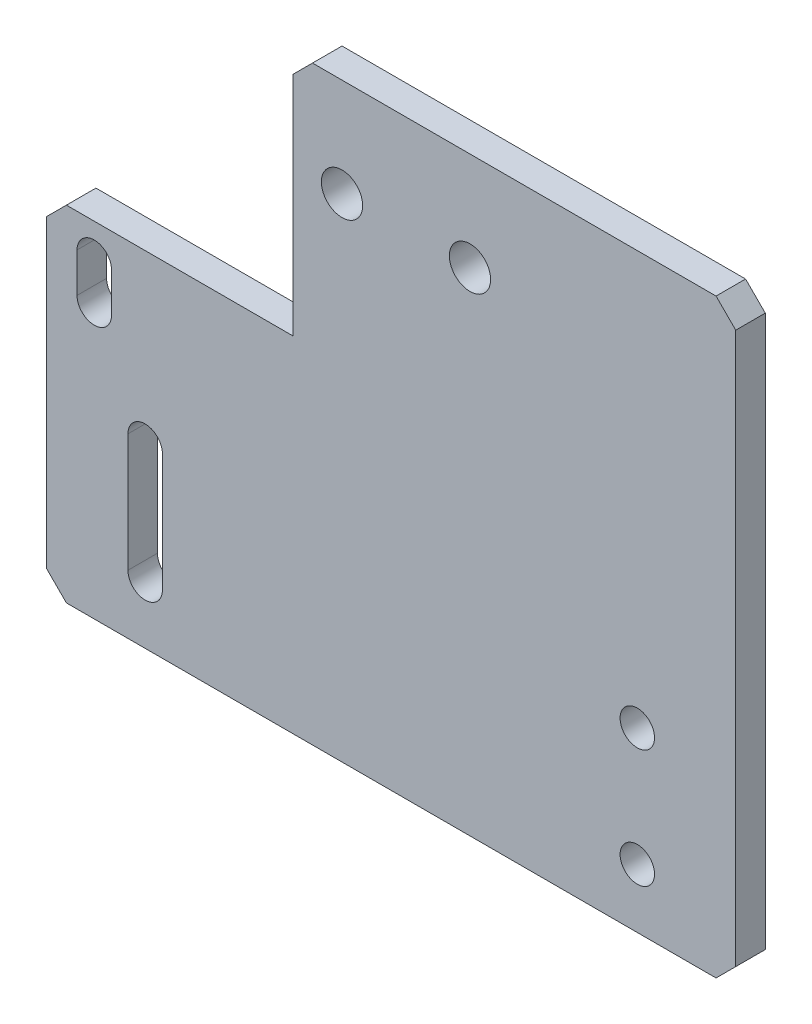
ISO-10303-21;
HEADER;
FILE_DESCRIPTION(('STEP AP214'),'2;1');
FILE_NAME('part.step','',(''),(''),'','','');
FILE_SCHEMA(('AUTOMOTIVE_DESIGN { 1 0 10303 214 1 1 1 1 }'));
ENDSEC;
DATA;
#1=APPLICATION_CONTEXT('core data for automotive mechanical design processes');
#2=APPLICATION_PROTOCOL_DEFINITION('international standard','automotive_design',2000,#1);
#3=PRODUCT_CONTEXT('',#1,'mechanical');
#4=PRODUCT('Part','Part','',(#3));
#5=PRODUCT_RELATED_PRODUCT_CATEGORY('part','',(#4));
#6=PRODUCT_DEFINITION_FORMATION('','',#4);
#7=PRODUCT_DEFINITION_CONTEXT('part definition',#1,'design');
#8=PRODUCT_DEFINITION('design','',#6,#7);
#9=PRODUCT_DEFINITION_SHAPE('','',#8);
#10=(LENGTH_UNIT() NAMED_UNIT(*) SI_UNIT(.MILLI.,.METRE.));
#11=(NAMED_UNIT(*) PLANE_ANGLE_UNIT() SI_UNIT($,.RADIAN.));
#12=(NAMED_UNIT(*) SI_UNIT($,.STERADIAN.) SOLID_ANGLE_UNIT());
#13=UNCERTAINTY_MEASURE_WITH_UNIT(LENGTH_MEASURE(1.E-05),#10,'distance_accuracy_value','');
#14=(GEOMETRIC_REPRESENTATION_CONTEXT(3) GLOBAL_UNCERTAINTY_ASSIGNED_CONTEXT((#13)) GLOBAL_UNIT_ASSIGNED_CONTEXT((#10,
#11,#12)) REPRESENTATION_CONTEXT('',''));
#15=CARTESIAN_POINT('',(0.,0.,0.));
#16=DIRECTION('',(0.,0.,1.));
#17=DIRECTION('',(1.,0.,0.));
#18=AXIS2_PLACEMENT_3D('',#15,#16,#17);
#19=CARTESIAN_POINT('',(0.,0.,3.));
#20=DIRECTION('',(0.,0.,-1.));
#21=DIRECTION('',(-1.,0.,0.));
#22=AXIS2_PLACEMENT_3D('',#19,#20,#21);
#23=PLANE('',#22);
#24=CARTESIAN_POINT('',(-26.8303571428571,-15.15625,3.));
#25=DIRECTION('',(0.,0.,1.));
#26=DIRECTION('',(1.,0.,0.));
#27=AXIS2_PLACEMENT_3D('',#24,#25,#26);
#28=CIRCLE('',#27,1.75);
#29=CARTESIAN_POINT('',(-25.0803571428571,-15.15625,3.));
#30=VERTEX_POINT('',#29);
#31=CARTESIAN_POINT('',(-28.5803571428571,-15.15625,3.));
#32=VERTEX_POINT('',#31);
#33=EDGE_CURVE('E211',#30,#32,#28,.T.);
#34=ORIENTED_EDGE('',*,*,#33,.F.);
#35=DIRECTION('',(0.,1.,0.));
#36=VECTOR('',#35,1.);
#37=CARTESIAN_POINT('',(-25.0803571428571,-15.15625,3.));
#38=LINE('',#37,#36);
#39=CARTESIAN_POINT('',(-25.0803571428571,-27.15625,3.));
#40=VERTEX_POINT('',#39);
#41=EDGE_CURVE('E219',#40,#30,#38,.T.);
#42=ORIENTED_EDGE('',*,*,#41,.F.);
#43=CARTESIAN_POINT('',(-26.8303571428571,-27.15625,3.));
#44=DIRECTION('',(0.,0.,1.));
#45=DIRECTION('',(1.,0.,0.));
#46=AXIS2_PLACEMENT_3D('',#43,#44,#45);
#47=CIRCLE('',#46,1.75);
#48=CARTESIAN_POINT('',(-28.5803571428571,-27.15625,3.));
#49=VERTEX_POINT('',#48);
#50=EDGE_CURVE('E216',#49,#40,#47,.T.);
#51=ORIENTED_EDGE('',*,*,#50,.F.);
#52=DIRECTION('',(0.,-1.,0.));
#53=VECTOR('',#52,1.);
#54=CARTESIAN_POINT('',(-28.5803571428571,-15.15625,3.));
#55=LINE('',#54,#53);
#56=EDGE_CURVE('E213',#32,#49,#55,.T.);
#57=ORIENTED_EDGE('',*,*,#56,.F.);
#58=EDGE_LOOP('',(#34,#42,#51,#57));
#59=FACE_BOUND('',#58,.T.);
#60=DIRECTION('',(-1.,0.,0.));
#61=VECTOR('',#60,1.);
#62=CARTESIAN_POINT('',(-36.8303571428571,1.84375,3.));
#63=LINE('',#62,#61);
#64=CARTESIAN_POINT('',(-11.8303571428571,1.84375,3.));
#65=VERTEX_POINT('',#64);
#66=CARTESIAN_POINT('',(-34.8303571428571,1.84375,3.));
#67=VERTEX_POINT('',#66);
#68=EDGE_CURVE('E262',#65,#67,#63,.T.);
#69=ORIENTED_EDGE('',*,*,#68,.T.);
#70=DIRECTION('',(0.707106781186548,0.707106781186548,0.));
#71=VECTOR('',#70,1.);
#72=CARTESIAN_POINT('',(-36.8303571428571,-0.156250000000004,3.));
#73=LINE('',#72,#71);
#74=CARTESIAN_POINT('',(-36.8303571428571,-0.156250000000004,3.));
#75=VERTEX_POINT('',#74);
#76=EDGE_CURVE('E317',#67,#75,#73,.F.);
#77=ORIENTED_EDGE('',*,*,#76,.T.);
#78=DIRECTION('',(0.,-1.,0.));
#79=VECTOR('',#78,1.);
#80=CARTESIAN_POINT('',(-36.8303571428571,-33.15625,3.));
#81=LINE('',#80,#79);
#82=CARTESIAN_POINT('',(-36.8303571428571,-31.15625,3.));
#83=VERTEX_POINT('',#82);
#84=EDGE_CURVE('E266',#75,#83,#81,.T.);
#85=ORIENTED_EDGE('',*,*,#84,.T.);
#86=DIRECTION('',(-0.707106781186545,0.70710678118655,0.));
#87=VECTOR('',#86,1.);
#88=CARTESIAN_POINT('',(-34.8303571428571,-33.15625,3.));
#89=LINE('',#88,#87);
#90=CARTESIAN_POINT('',(-34.8303571428571,-33.15625,3.));
#91=VERTEX_POINT('',#90);
#92=EDGE_CURVE('E315',#83,#91,#89,.F.);
#93=ORIENTED_EDGE('',*,*,#92,.T.);
#94=DIRECTION('',(1.,0.,0.));
#95=VECTOR('',#94,1.);
#96=CARTESIAN_POINT('',(33.1696428571429,-33.15625,3.));
#97=LINE('',#96,#95);
#98=CARTESIAN_POINT('',(31.1696428571429,-33.15625,3.));
#99=VERTEX_POINT('',#98);
#100=EDGE_CURVE('E269',#91,#99,#97,.T.);
#101=ORIENTED_EDGE('',*,*,#100,.T.);
#102=DIRECTION('',(-0.70710678118655,-0.707106781186545,0.));
#103=VECTOR('',#102,1.);
#104=CARTESIAN_POINT('',(33.1696428571429,-31.15625,3.));
#105=LINE('',#104,#103);
#106=CARTESIAN_POINT('',(33.1696428571429,-31.15625,3.));
#107=VERTEX_POINT('',#106);
#108=EDGE_CURVE('E313',#99,#107,#105,.F.);
#109=ORIENTED_EDGE('',*,*,#108,.T.);
#110=DIRECTION('',(0.,1.,0.));
#111=VECTOR('',#110,1.);
#112=CARTESIAN_POINT('',(33.1696428571429,26.84375,3.));
#113=LINE('',#112,#111);
#114=CARTESIAN_POINT('',(33.1696428571429,24.84375,3.));
#115=VERTEX_POINT('',#114);
#116=EDGE_CURVE('E272',#107,#115,#113,.T.);
#117=ORIENTED_EDGE('',*,*,#116,.T.);
#118=DIRECTION('',(0.707106781186545,-0.70710678118655,0.));
#119=VECTOR('',#118,1.);
#120=CARTESIAN_POINT('',(31.1696428571429,26.84375,3.));
#121=LINE('',#120,#119);
#122=CARTESIAN_POINT('',(31.1696428571428,26.84375,3.));
#123=VERTEX_POINT('',#122);
#124=EDGE_CURVE('E55',#115,#123,#121,.F.);
#125=ORIENTED_EDGE('',*,*,#124,.T.);
#126=DIRECTION('',(-1.,0.,0.));
#127=VECTOR('',#126,1.);
#128=CARTESIAN_POINT('',(-11.8303571428571,26.84375,3.));
#129=LINE('',#128,#127);
#130=CARTESIAN_POINT('',(-9.83035714285712,26.84375,3.));
#131=VERTEX_POINT('',#130);
#132=EDGE_CURVE('E274',#123,#131,#129,.T.);
#133=ORIENTED_EDGE('',*,*,#132,.T.);
#134=DIRECTION('',(0.70710678118655,0.707106781186545,0.));
#135=VECTOR('',#134,1.);
#136=CARTESIAN_POINT('',(-11.8303571428571,24.84375,3.));
#137=LINE('',#136,#135);
#138=CARTESIAN_POINT('',(-11.8303571428571,24.84375,3.));
#139=VERTEX_POINT('',#138);
#140=EDGE_CURVE('E310',#131,#139,#137,.F.);
#141=ORIENTED_EDGE('',*,*,#140,.T.);
#142=DIRECTION('',(0.,-1.,0.));
#143=VECTOR('',#142,1.);
#144=CARTESIAN_POINT('',(-11.8303571428571,1.84375,3.));
#145=LINE('',#144,#143);
#146=EDGE_CURVE('E260',#139,#65,#145,.T.);
#147=ORIENTED_EDGE('',*,*,#146,.T.);
#148=EDGE_LOOP('',(#69,#77,#85,#93,#101,#109,#117,#125,#133,#141,#147));
#149=FACE_BOUND('',#148,.T.);
#150=CARTESIAN_POINT('',(23.1696428571429,-15.15625,3.));
#151=DIRECTION('',(0.,0.,1.));
#152=DIRECTION('',(1.,0.,0.));
#153=AXIS2_PLACEMENT_3D('',#150,#151,#152);
#154=CIRCLE('',#153,1.75);
#155=CARTESIAN_POINT('',(24.9196428571429,-15.15625,3.));
#156=VERTEX_POINT('',#155);
#157=EDGE_CURVE('E254',#156,#156,#154,.T.);
#158=ORIENTED_EDGE('',*,*,#157,.F.);
#159=EDGE_LOOP('',(#158));
#160=FACE_BOUND('',#159,.T.);
#161=CARTESIAN_POINT('',(23.1696428571429,-27.15625,3.));
#162=DIRECTION('',(0.,0.,1.));
#163=DIRECTION('',(1.,0.,0.));
#164=AXIS2_PLACEMENT_3D('',#161,#162,#163);
#165=CIRCLE('',#164,1.75);
#166=CARTESIAN_POINT('',(24.9196428571429,-27.15625,3.));
#167=VERTEX_POINT('',#166);
#168=EDGE_CURVE('E248',#167,#167,#165,.T.);
#169=ORIENTED_EDGE('',*,*,#168,.F.);
#170=EDGE_LOOP('',(#169));
#171=FACE_BOUND('',#170,.T.);
#172=CARTESIAN_POINT('',(-6.83035714285712,16.84375,3.));
#173=DIRECTION('',(0.,0.,1.));
#174=DIRECTION('',(1.,0.,0.));
#175=AXIS2_PLACEMENT_3D('',#172,#173,#174);
#176=CIRCLE('',#175,2.09631372890607);
#177=CARTESIAN_POINT('',(-4.73404341395105,16.84375,3.));
#178=VERTEX_POINT('',#177);
#179=EDGE_CURVE('E242',#178,#178,#176,.T.);
#180=ORIENTED_EDGE('',*,*,#179,.F.);
#181=EDGE_LOOP('',(#180));
#182=FACE_BOUND('',#181,.T.);
#183=CARTESIAN_POINT('',(-32.,-1.55803571428572,3.));
#184=DIRECTION('',(0.,0.,1.));
#185=DIRECTION('',(1.,0.,0.));
#186=AXIS2_PLACEMENT_3D('',#183,#184,#185);
#187=CIRCLE('',#186,1.75);
#188=CARTESIAN_POINT('',(-30.25,-1.55803571428572,3.));
#189=VERTEX_POINT('',#188);
#190=CARTESIAN_POINT('',(-33.75,-1.55803571428572,3.));
#191=VERTEX_POINT('',#190);
#192=EDGE_CURVE('E167',#189,#191,#187,.T.);
#193=ORIENTED_EDGE('',*,*,#192,.F.);
#194=DIRECTION('',(0.,1.,0.));
#195=VECTOR('',#194,1.);
#196=CARTESIAN_POINT('',(-30.25,-1.55803571428572,3.));
#197=LINE('',#196,#195);
#198=CARTESIAN_POINT('',(-30.25,-5.55803571428572,3.));
#199=VERTEX_POINT('',#198);
#200=EDGE_CURVE('E193',#199,#189,#197,.T.);
#201=ORIENTED_EDGE('',*,*,#200,.F.);
#202=CARTESIAN_POINT('',(-32.,-5.55803571428572,3.));
#203=DIRECTION('',(0.,0.,1.));
#204=DIRECTION('',(1.,0.,0.));
#205=AXIS2_PLACEMENT_3D('',#202,#203,#204);
#206=CIRCLE('',#205,1.75);
#207=CARTESIAN_POINT('',(-33.75,-5.55803571428572,3.));
#208=VERTEX_POINT('',#207);
#209=EDGE_CURVE('E191',#208,#199,#206,.T.);
#210=ORIENTED_EDGE('',*,*,#209,.F.);
#211=DIRECTION('',(0.,-1.,0.));
#212=VECTOR('',#211,1.);
#213=CARTESIAN_POINT('',(-33.75,-1.55803571428572,3.));
#214=LINE('',#213,#212);
#215=EDGE_CURVE('E177',#191,#208,#214,.T.);
#216=ORIENTED_EDGE('',*,*,#215,.F.);
#217=EDGE_LOOP('',(#193,#201,#210,#216));
#218=FACE_BOUND('',#217,.T.);
#219=CARTESIAN_POINT('',(6.16964285714288,16.84375,3.));
#220=DIRECTION('',(0.,0.,1.));
#221=DIRECTION('',(1.,0.,0.));
#222=AXIS2_PLACEMENT_3D('',#219,#220,#221);
#223=CIRCLE('',#222,2.09631372890607);
#224=CARTESIAN_POINT('',(8.26595658604895,16.84375,3.));
#225=VERTEX_POINT('',#224);
#226=EDGE_CURVE('E200',#225,#225,#223,.T.);
#227=ORIENTED_EDGE('',*,*,#226,.F.);
#228=EDGE_LOOP('',(#227));
#229=FACE_BOUND('',#228,.T.);
#230=ADVANCED_FACE('F33',(#59,#149,#160,#171,#182,#218,#229),#23,.F.);
#231=CARTESIAN_POINT('',(0.,0.,0.));
#232=DIRECTION('',(0.,0.,-1.));
#233=DIRECTION('',(-1.,0.,0.));
#234=AXIS2_PLACEMENT_3D('',#231,#232,#233);
#235=PLANE('',#234);
#236=DIRECTION('',(0.,1.,0.));
#237=VECTOR('',#236,1.);
#238=CARTESIAN_POINT('',(-30.25,-1.55803571428572,0.));
#239=LINE('',#238,#237);
#240=CARTESIAN_POINT('',(-30.25,-5.55803571428572,0.));
#241=VERTEX_POINT('',#240);
#242=CARTESIAN_POINT('',(-30.25,-1.55803571428572,0.));
#243=VERTEX_POINT('',#242);
#244=EDGE_CURVE('E178',#241,#243,#239,.T.);
#245=ORIENTED_EDGE('',*,*,#244,.T.);
#246=CARTESIAN_POINT('',(-32.,-1.55803571428572,0.));
#247=DIRECTION('',(0.,0.,1.));
#248=DIRECTION('',(1.,0.,0.));
#249=AXIS2_PLACEMENT_3D('',#246,#247,#248);
#250=CIRCLE('',#249,1.75);
#251=CARTESIAN_POINT('',(-33.75,-1.55803571428572,0.));
#252=VERTEX_POINT('',#251);
#253=EDGE_CURVE('E198',#243,#252,#250,.T.);
#254=ORIENTED_EDGE('',*,*,#253,.T.);
#255=DIRECTION('',(0.,-1.,0.));
#256=VECTOR('',#255,1.);
#257=CARTESIAN_POINT('',(-33.75,-1.55803571428572,0.));
#258=LINE('',#257,#256);
#259=CARTESIAN_POINT('',(-33.75,-5.55803571428572,0.));
#260=VERTEX_POINT('',#259);
#261=EDGE_CURVE('E184',#252,#260,#258,.T.);
#262=ORIENTED_EDGE('',*,*,#261,.T.);
#263=CARTESIAN_POINT('',(-32.,-5.55803571428572,0.));
#264=DIRECTION('',(0.,0.,1.));
#265=DIRECTION('',(1.,0.,0.));
#266=AXIS2_PLACEMENT_3D('',#263,#264,#265);
#267=CIRCLE('',#266,1.75);
#268=EDGE_CURVE('E202',#260,#241,#267,.T.);
#269=ORIENTED_EDGE('',*,*,#268,.T.);
#270=EDGE_LOOP('',(#245,#254,#262,#269));
#271=FACE_BOUND('',#270,.T.);
#272=DIRECTION('',(0.,1.,0.));
#273=VECTOR('',#272,1.);
#274=CARTESIAN_POINT('',(-25.0803571428571,-15.15625,0.));
#275=LINE('',#274,#273);
#276=CARTESIAN_POINT('',(-25.0803571428571,-27.15625,0.));
#277=VERTEX_POINT('',#276);
#278=CARTESIAN_POINT('',(-25.0803571428571,-15.15625,0.));
#279=VERTEX_POINT('',#278);
#280=EDGE_CURVE('E214',#277,#279,#275,.T.);
#281=ORIENTED_EDGE('',*,*,#280,.T.);
#282=CARTESIAN_POINT('',(-26.8303571428571,-15.15625,0.));
#283=DIRECTION('',(0.,0.,1.));
#284=DIRECTION('',(1.,0.,0.));
#285=AXIS2_PLACEMENT_3D('',#282,#283,#284);
#286=CIRCLE('',#285,1.75);
#287=CARTESIAN_POINT('',(-28.5803571428571,-15.15625,0.));
#288=VERTEX_POINT('',#287);
#289=EDGE_CURVE('E185',#279,#288,#286,.T.);
#290=ORIENTED_EDGE('',*,*,#289,.T.);
#291=DIRECTION('',(0.,-1.,0.));
#292=VECTOR('',#291,1.);
#293=CARTESIAN_POINT('',(-28.5803571428571,-15.15625,0.));
#294=LINE('',#293,#292);
#295=CARTESIAN_POINT('',(-28.5803571428571,-27.15625,0.));
#296=VERTEX_POINT('',#295);
#297=EDGE_CURVE('E224',#288,#296,#294,.T.);
#298=ORIENTED_EDGE('',*,*,#297,.T.);
#299=CARTESIAN_POINT('',(-26.8303571428571,-27.15625,0.));
#300=DIRECTION('',(0.,0.,1.));
#301=DIRECTION('',(1.,0.,0.));
#302=AXIS2_PLACEMENT_3D('',#299,#300,#301);
#303=CIRCLE('',#302,1.75);
#304=EDGE_CURVE('E227',#296,#277,#303,.T.);
#305=ORIENTED_EDGE('',*,*,#304,.T.);
#306=EDGE_LOOP('',(#281,#290,#298,#305));
#307=FACE_BOUND('',#306,.T.);
#308=CARTESIAN_POINT('',(-6.83035714285712,16.84375,0.));
#309=DIRECTION('',(0.,0.,1.));
#310=DIRECTION('',(1.,0.,0.));
#311=AXIS2_PLACEMENT_3D('',#308,#309,#310);
#312=CIRCLE('',#311,2.09631372890607);
#313=CARTESIAN_POINT('',(-4.73404341395105,16.84375,0.));
#314=VERTEX_POINT('',#313);
#315=EDGE_CURVE('E241',#314,#314,#312,.T.);
#316=ORIENTED_EDGE('',*,*,#315,.T.);
#317=EDGE_LOOP('',(#316));
#318=FACE_BOUND('',#317,.T.);
#319=CARTESIAN_POINT('',(23.1696428571429,-15.15625,0.));
#320=DIRECTION('',(0.,0.,1.));
#321=DIRECTION('',(1.,0.,0.));
#322=AXIS2_PLACEMENT_3D('',#319,#320,#321);
#323=CIRCLE('',#322,1.75);
#324=CARTESIAN_POINT('',(24.9196428571429,-15.15625,0.));
#325=VERTEX_POINT('',#324);
#326=EDGE_CURVE('E251',#325,#325,#323,.T.);
#327=ORIENTED_EDGE('',*,*,#326,.T.);
#328=EDGE_LOOP('',(#327));
#329=FACE_BOUND('',#328,.T.);
#330=DIRECTION('',(0.,-1.,0.));
#331=VECTOR('',#330,1.);
#332=CARTESIAN_POINT('',(-36.8303571428571,-33.15625,0.));
#333=LINE('',#332,#331);
#334=CARTESIAN_POINT('',(-36.8303571428571,-0.156250000000004,0.));
#335=VERTEX_POINT('',#334);
#336=CARTESIAN_POINT('',(-36.8303571428571,-31.15625,0.));
#337=VERTEX_POINT('',#336);
#338=EDGE_CURVE('E281',#335,#337,#333,.T.);
#339=ORIENTED_EDGE('',*,*,#338,.F.);
#340=DIRECTION('',(-0.707106781186548,-0.707106781186548,0.));
#341=VECTOR('',#340,1.);
#342=CARTESIAN_POINT('',(-18.3370535714286,18.3370535714286,0.));
#343=LINE('',#342,#341);
#344=CARTESIAN_POINT('',(-34.8303571428571,1.84375,0.));
#345=VERTEX_POINT('',#344);
#346=EDGE_CURVE('E306',#335,#345,#343,.F.);
#347=ORIENTED_EDGE('',*,*,#346,.T.);
#348=DIRECTION('',(-1.,0.,0.));
#349=VECTOR('',#348,1.);
#350=CARTESIAN_POINT('',(-36.8303571428571,1.84375,0.));
#351=LINE('',#350,#349);
#352=CARTESIAN_POINT('',(-11.8303571428571,1.84375,0.));
#353=VERTEX_POINT('',#352);
#354=EDGE_CURVE('E278',#353,#345,#351,.T.);
#355=ORIENTED_EDGE('',*,*,#354,.F.);
#356=DIRECTION('',(0.,-1.,0.));
#357=VECTOR('',#356,1.);
#358=CARTESIAN_POINT('',(-11.8303571428571,1.84375,0.));
#359=LINE('',#358,#357);
#360=CARTESIAN_POINT('',(-11.8303571428571,24.84375,0.));
#361=VERTEX_POINT('',#360);
#362=EDGE_CURVE('E257',#361,#353,#359,.T.);
#363=ORIENTED_EDGE('',*,*,#362,.F.);
#364=DIRECTION('',(-0.70710678118655,-0.707106781186545,0.));
#365=VECTOR('',#364,1.);
#366=CARTESIAN_POINT('',(-18.3370535714285,18.3370535714287,0.));
#367=LINE('',#366,#365);
#368=CARTESIAN_POINT('',(-9.83035714285712,26.84375,0.));
#369=VERTEX_POINT('',#368);
#370=EDGE_CURVE('E298',#361,#369,#367,.F.);
#371=ORIENTED_EDGE('',*,*,#370,.T.);
#372=DIRECTION('',(-1.,0.,0.));
#373=VECTOR('',#372,1.);
#374=CARTESIAN_POINT('',(-11.8303571428571,26.84375,0.));
#375=LINE('',#374,#373);
#376=CARTESIAN_POINT('',(31.1696428571428,26.84375,0.));
#377=VERTEX_POINT('',#376);
#378=EDGE_CURVE('E263',#377,#369,#375,.T.);
#379=ORIENTED_EDGE('',*,*,#378,.F.);
#380=DIRECTION('',(-0.707106781186545,0.70710678118655,0.));
#381=VECTOR('',#380,1.);
#382=CARTESIAN_POINT('',(29.0066964285715,29.0066964285713,0.));
#383=LINE('',#382,#381);
#384=CARTESIAN_POINT('',(33.1696428571429,24.84375,0.));
#385=VERTEX_POINT('',#384);
#386=EDGE_CURVE('E300',#377,#385,#383,.F.);
#387=ORIENTED_EDGE('',*,*,#386,.T.);
#388=DIRECTION('',(0.,1.,0.));
#389=VECTOR('',#388,1.);
#390=CARTESIAN_POINT('',(33.1696428571429,26.84375,0.));
#391=LINE('',#390,#389);
#392=CARTESIAN_POINT('',(33.1696428571429,-31.15625,0.));
#393=VERTEX_POINT('',#392);
#394=EDGE_CURVE('E287',#393,#385,#391,.T.);
#395=ORIENTED_EDGE('',*,*,#394,.F.);
#396=DIRECTION('',(0.70710678118655,0.707106781186545,0.));
#397=VECTOR('',#396,1.);
#398=CARTESIAN_POINT('',(32.1629464285713,-32.1629464285716,0.));
#399=LINE('',#398,#397);
#400=CARTESIAN_POINT('',(31.1696428571429,-33.15625,0.));
#401=VERTEX_POINT('',#400);
#402=EDGE_CURVE('E302',#393,#401,#399,.F.);
#403=ORIENTED_EDGE('',*,*,#402,.T.);
#404=DIRECTION('',(1.,0.,0.));
#405=VECTOR('',#404,1.);
#406=CARTESIAN_POINT('',(33.1696428571429,-33.15625,0.));
#407=LINE('',#406,#405);
#408=CARTESIAN_POINT('',(-34.8303571428571,-33.15625,0.));
#409=VERTEX_POINT('',#408);
#410=EDGE_CURVE('E284',#409,#401,#407,.T.);
#411=ORIENTED_EDGE('',*,*,#410,.F.);
#412=DIRECTION('',(0.707106781186545,-0.70710678118655,0.));
#413=VECTOR('',#412,1.);
#414=CARTESIAN_POINT('',(-33.9933035714287,-33.9933035714284,0.));
#415=LINE('',#414,#413);
#416=EDGE_CURVE('E304',#409,#337,#415,.F.);
#417=ORIENTED_EDGE('',*,*,#416,.T.);
#418=EDGE_LOOP('',(#339,#347,#355,#363,#371,#379,#387,#395,#403,#411,#417));
#419=FACE_BOUND('',#418,.T.);
#420=CARTESIAN_POINT('',(23.1696428571429,-27.15625,0.));
#421=DIRECTION('',(0.,0.,1.));
#422=DIRECTION('',(1.,0.,0.));
#423=AXIS2_PLACEMENT_3D('',#420,#421,#422);
#424=CIRCLE('',#423,1.75);
#425=CARTESIAN_POINT('',(24.9196428571429,-27.15625,0.));
#426=VERTEX_POINT('',#425);
#427=EDGE_CURVE('E245',#426,#426,#424,.T.);
#428=ORIENTED_EDGE('',*,*,#427,.T.);
#429=EDGE_LOOP('',(#428));
#430=FACE_BOUND('',#429,.T.);
#431=CARTESIAN_POINT('',(6.16964285714288,16.84375,0.));
#432=DIRECTION('',(0.,0.,1.));
#433=DIRECTION('',(1.,0.,0.));
#434=AXIS2_PLACEMENT_3D('',#431,#432,#433);
#435=CIRCLE('',#434,2.09631372890607);
#436=CARTESIAN_POINT('',(8.26595658604895,16.84375,0.));
#437=VERTEX_POINT('',#436);
#438=EDGE_CURVE('E616',#437,#437,#435,.T.);
#439=ORIENTED_EDGE('',*,*,#438,.T.);
#440=EDGE_LOOP('',(#439));
#441=FACE_BOUND('',#440,.T.);
#442=ADVANCED_FACE('F336',(#271,#307,#318,#329,#419,#430,#441),#235,.T.);
#443=CARTESIAN_POINT('',(-11.8303571428571,1.84375,3.));
#444=DIRECTION('',(1.,0.,0.));
#445=DIRECTION('',(0.,0.,-1.));
#446=AXIS2_PLACEMENT_3D('',#443,#444,#445);
#447=PLANE('',#446);
#448=ORIENTED_EDGE('',*,*,#146,.F.);
#449=DIRECTION('',(0.,0.,-1.));
#450=VECTOR('',#449,1.);
#451=CARTESIAN_POINT('',(-11.8303571428571,24.84375,3.));
#452=LINE('',#451,#450);
#453=EDGE_CURVE('E11',#139,#361,#452,.T.);
#454=ORIENTED_EDGE('',*,*,#453,.T.);
#455=ORIENTED_EDGE('',*,*,#362,.T.);
#456=DIRECTION('',(0.,0.,-1.));
#457=VECTOR('',#456,1.);
#458=CARTESIAN_POINT('',(-11.8303571428571,1.84375,3.));
#459=LINE('',#458,#457);
#460=EDGE_CURVE('E276',#65,#353,#459,.T.);
#461=ORIENTED_EDGE('',*,*,#460,.F.);
#462=EDGE_LOOP('',(#448,#454,#455,#461));
#463=FACE_BOUND('',#462,.T.);
#464=ADVANCED_FACE('F346',(#463),#447,.F.);
#465=CARTESIAN_POINT('',(-36.8303571428571,1.84375,3.));
#466=DIRECTION('',(0.,-1.,0.));
#467=DIRECTION('',(1.,0.,0.));
#468=AXIS2_PLACEMENT_3D('',#465,#466,#467);
#469=PLANE('',#468);
#470=ORIENTED_EDGE('',*,*,#354,.T.);
#471=DIRECTION('',(0.,0.,1.));
#472=VECTOR('',#471,1.);
#473=CARTESIAN_POINT('',(-34.8303571428571,1.84375,3.));
#474=LINE('',#473,#472);
#475=EDGE_CURVE('E308',#345,#67,#474,.T.);
#476=ORIENTED_EDGE('',*,*,#475,.T.);
#477=ORIENTED_EDGE('',*,*,#68,.F.);
#478=ORIENTED_EDGE('',*,*,#460,.T.);
#479=EDGE_LOOP('',(#470,#476,#477,#478));
#480=FACE_BOUND('',#479,.T.);
#481=ADVANCED_FACE('F352',(#480),#469,.F.);
#482=CARTESIAN_POINT('',(-36.8303571428571,-33.15625,3.));
#483=DIRECTION('',(1.,0.,0.));
#484=DIRECTION('',(0.,1.,0.));
#485=AXIS2_PLACEMENT_3D('',#482,#483,#484);
#486=PLANE('',#485);
#487=ORIENTED_EDGE('',*,*,#84,.F.);
#488=DIRECTION('',(0.,0.,-1.));
#489=VECTOR('',#488,1.);
#490=CARTESIAN_POINT('',(-36.8303571428571,-0.156250000000004,3.));
#491=LINE('',#490,#489);
#492=EDGE_CURVE('E295',#75,#335,#491,.T.);
#493=ORIENTED_EDGE('',*,*,#492,.T.);
#494=ORIENTED_EDGE('',*,*,#338,.T.);
#495=DIRECTION('',(0.,0.,1.));
#496=VECTOR('',#495,1.);
#497=CARTESIAN_POINT('',(-36.8303571428571,-31.15625,3.));
#498=LINE('',#497,#496);
#499=EDGE_CURVE('E293',#337,#83,#498,.T.);
#500=ORIENTED_EDGE('',*,*,#499,.T.);
#501=EDGE_LOOP('',(#487,#493,#494,#500));
#502=FACE_BOUND('',#501,.T.);
#503=ADVANCED_FACE('F360',(#502),#486,.F.);
#504=CARTESIAN_POINT('',(33.1696428571429,-33.15625,3.));
#505=DIRECTION('',(0.,1.,0.));
#506=DIRECTION('',(-1.,0.,0.));
#507=AXIS2_PLACEMENT_3D('',#504,#505,#506);
#508=PLANE('',#507);
#509=ORIENTED_EDGE('',*,*,#100,.F.);
#510=DIRECTION('',(0.,0.,-1.));
#511=VECTOR('',#510,1.);
#512=CARTESIAN_POINT('',(-34.8303571428571,-33.15625,3.));
#513=LINE('',#512,#511);
#514=EDGE_CURVE('E321',#91,#409,#513,.T.);
#515=ORIENTED_EDGE('',*,*,#514,.T.);
#516=ORIENTED_EDGE('',*,*,#410,.T.);
#517=DIRECTION('',(0.,0.,1.));
#518=VECTOR('',#517,1.);
#519=CARTESIAN_POINT('',(31.1696428571429,-33.15625,3.));
#520=LINE('',#519,#518);
#521=EDGE_CURVE('E319',#401,#99,#520,.T.);
#522=ORIENTED_EDGE('',*,*,#521,.T.);
#523=EDGE_LOOP('',(#509,#515,#516,#522));
#524=FACE_BOUND('',#523,.T.);
#525=ADVANCED_FACE('F368',(#524),#508,.F.);
#526=CARTESIAN_POINT('',(33.1696428571429,26.84375,3.));
#527=DIRECTION('',(-1.,0.,0.));
#528=DIRECTION('',(0.,-1.,0.));
#529=AXIS2_PLACEMENT_3D('',#526,#527,#528);
#530=PLANE('',#529);
#531=ORIENTED_EDGE('',*,*,#116,.F.);
#532=DIRECTION('',(0.,0.,-1.));
#533=VECTOR('',#532,1.);
#534=CARTESIAN_POINT('',(33.1696428571429,-31.15625,3.));
#535=LINE('',#534,#533);
#536=EDGE_CURVE('E326',#107,#393,#535,.T.);
#537=ORIENTED_EDGE('',*,*,#536,.T.);
#538=ORIENTED_EDGE('',*,*,#394,.T.);
#539=DIRECTION('',(0.,0.,1.));
#540=VECTOR('',#539,1.);
#541=CARTESIAN_POINT('',(33.1696428571429,24.84375,3.));
#542=LINE('',#541,#540);
#543=EDGE_CURVE('E324',#385,#115,#542,.T.);
#544=ORIENTED_EDGE('',*,*,#543,.T.);
#545=EDGE_LOOP('',(#531,#537,#538,#544));
#546=FACE_BOUND('',#545,.T.);
#547=ADVANCED_FACE('F376',(#546),#530,.F.);
#548=CARTESIAN_POINT('',(-11.8303571428571,26.84375,3.));
#549=DIRECTION('',(0.,-1.,0.));
#550=DIRECTION('',(1.,0.,0.));
#551=AXIS2_PLACEMENT_3D('',#548,#549,#550);
#552=PLANE('',#551);
#553=ORIENTED_EDGE('',*,*,#132,.F.);
#554=DIRECTION('',(0.,0.,-1.));
#555=VECTOR('',#554,1.);
#556=CARTESIAN_POINT('',(31.1696428571429,26.84375,3.));
#557=LINE('',#556,#555);
#558=EDGE_CURVE('E41',#123,#377,#557,.T.);
#559=ORIENTED_EDGE('',*,*,#558,.T.);
#560=ORIENTED_EDGE('',*,*,#378,.T.);
#561=DIRECTION('',(0.,0.,1.));
#562=VECTOR('',#561,1.);
#563=CARTESIAN_POINT('',(-9.83035714285712,26.84375,3.));
#564=LINE('',#563,#562);
#565=EDGE_CURVE('E48',#369,#131,#564,.T.);
#566=ORIENTED_EDGE('',*,*,#565,.T.);
#567=EDGE_LOOP('',(#553,#559,#560,#566));
#568=FACE_BOUND('',#567,.T.);
#569=ADVANCED_FACE('F332',(#568),#552,.F.);
#570=CARTESIAN_POINT('',(23.1696428571429,-15.15625,3.));
#571=DIRECTION('',(0.,0.,-1.));
#572=DIRECTION('',(-1.,0.,0.));
#573=AXIS2_PLACEMENT_3D('',#570,#571,#572);
#574=CYLINDRICAL_SURFACE('',#573,1.75);
#575=ORIENTED_EDGE('',*,*,#157,.T.);
#576=EDGE_LOOP('',(#575));
#577=FACE_BOUND('',#576,.T.);
#578=ORIENTED_EDGE('',*,*,#326,.F.);
#579=EDGE_LOOP('',(#578));
#580=FACE_BOUND('',#579,.T.);
#581=ADVANCED_FACE('F395',(#577,#580),#574,.F.);
#582=CARTESIAN_POINT('',(23.1696428571429,-27.15625,3.));
#583=DIRECTION('',(0.,0.,-1.));
#584=DIRECTION('',(-1.,0.,0.));
#585=AXIS2_PLACEMENT_3D('',#582,#583,#584);
#586=CYLINDRICAL_SURFACE('',#585,1.75);
#587=ORIENTED_EDGE('',*,*,#168,.T.);
#588=EDGE_LOOP('',(#587));
#589=FACE_BOUND('',#588,.T.);
#590=ORIENTED_EDGE('',*,*,#427,.F.);
#591=EDGE_LOOP('',(#590));
#592=FACE_BOUND('',#591,.T.);
#593=ADVANCED_FACE('F526',(#589,#592),#586,.F.);
#594=CARTESIAN_POINT('',(-6.83035714285712,16.84375,3.));
#595=DIRECTION('',(0.,0.,-1.));
#596=DIRECTION('',(-1.,0.,0.));
#597=AXIS2_PLACEMENT_3D('',#594,#595,#596);
#598=CYLINDRICAL_SURFACE('',#597,2.09631372890607);
#599=ORIENTED_EDGE('',*,*,#179,.T.);
#600=EDGE_LOOP('',(#599));
#601=FACE_BOUND('',#600,.T.);
#602=ORIENTED_EDGE('',*,*,#315,.F.);
#603=EDGE_LOOP('',(#602));
#604=FACE_BOUND('',#603,.T.);
#605=ADVANCED_FACE('F517',(#601,#604),#598,.F.);
#606=CARTESIAN_POINT('',(-26.8303571428571,-15.15625,3.));
#607=DIRECTION('',(0.,0.,-1.));
#608=DIRECTION('',(-1.,0.,0.));
#609=AXIS2_PLACEMENT_3D('',#606,#607,#608);
#610=CYLINDRICAL_SURFACE('',#609,1.75);
#611=ORIENTED_EDGE('',*,*,#289,.F.);
#612=DIRECTION('',(0.,0.,-1.));
#613=VECTOR('',#612,1.);
#614=CARTESIAN_POINT('',(-25.0803571428571,-15.15625,3.));
#615=LINE('',#614,#613);
#616=EDGE_CURVE('E221',#30,#279,#615,.T.);
#617=ORIENTED_EDGE('',*,*,#616,.F.);
#618=ORIENTED_EDGE('',*,*,#33,.T.);
#619=DIRECTION('',(0.,0.,-1.));
#620=VECTOR('',#619,1.);
#621=CARTESIAN_POINT('',(-28.5803571428571,-15.15625,3.));
#622=LINE('',#621,#620);
#623=EDGE_CURVE('E238',#32,#288,#622,.T.);
#624=ORIENTED_EDGE('',*,*,#623,.T.);
#625=EDGE_LOOP('',(#611,#617,#618,#624));
#626=FACE_BOUND('',#625,.T.);
#627=ADVANCED_FACE('F508',(#626),#610,.F.);
#628=CARTESIAN_POINT('',(-28.5803571428571,-15.15625,3.));
#629=DIRECTION('',(1.,0.,0.));
#630=DIRECTION('',(0.,1.,0.));
#631=AXIS2_PLACEMENT_3D('',#628,#629,#630);
#632=PLANE('',#631);
#633=ORIENTED_EDGE('',*,*,#297,.F.);
#634=ORIENTED_EDGE('',*,*,#623,.F.);
#635=ORIENTED_EDGE('',*,*,#56,.T.);
#636=DIRECTION('',(0.,0.,-1.));
#637=VECTOR('',#636,1.);
#638=CARTESIAN_POINT('',(-28.5803571428571,-27.15625,3.));
#639=LINE('',#638,#637);
#640=EDGE_CURVE('E236',#49,#296,#639,.T.);
#641=ORIENTED_EDGE('',*,*,#640,.T.);
#642=EDGE_LOOP('',(#633,#634,#635,#641));
#643=FACE_BOUND('',#642,.T.);
#644=ADVANCED_FACE('F499',(#643),#632,.T.);
#645=CARTESIAN_POINT('',(-26.8303571428571,-27.15625,3.));
#646=DIRECTION('',(0.,0.,-1.));
#647=DIRECTION('',(-1.,0.,0.));
#648=AXIS2_PLACEMENT_3D('',#645,#646,#647);
#649=CYLINDRICAL_SURFACE('',#648,1.75);
#650=ORIENTED_EDGE('',*,*,#304,.F.);
#651=ORIENTED_EDGE('',*,*,#640,.F.);
#652=ORIENTED_EDGE('',*,*,#50,.T.);
#653=DIRECTION('',(0.,0.,-1.));
#654=VECTOR('',#653,1.);
#655=CARTESIAN_POINT('',(-25.0803571428571,-27.15625,3.));
#656=LINE('',#655,#654);
#657=EDGE_CURVE('E234',#40,#277,#656,.T.);
#658=ORIENTED_EDGE('',*,*,#657,.T.);
#659=EDGE_LOOP('',(#650,#651,#652,#658));
#660=FACE_BOUND('',#659,.T.);
#661=ADVANCED_FACE('F490',(#660),#649,.F.);
#662=CARTESIAN_POINT('',(-25.0803571428571,-15.15625,3.));
#663=DIRECTION('',(-1.,0.,0.));
#664=DIRECTION('',(0.,-1.,0.));
#665=AXIS2_PLACEMENT_3D('',#662,#663,#664);
#666=PLANE('',#665);
#667=ORIENTED_EDGE('',*,*,#280,.F.);
#668=ORIENTED_EDGE('',*,*,#657,.F.);
#669=ORIENTED_EDGE('',*,*,#41,.T.);
#670=ORIENTED_EDGE('',*,*,#616,.T.);
#671=EDGE_LOOP('',(#667,#668,#669,#670));
#672=FACE_BOUND('',#671,.T.);
#673=ADVANCED_FACE('F482',(#672),#666,.T.);
#674=CARTESIAN_POINT('',(-32.,-1.55803571428572,3.));
#675=DIRECTION('',(0.,0.,-1.));
#676=DIRECTION('',(-1.,0.,0.));
#677=AXIS2_PLACEMENT_3D('',#674,#675,#676);
#678=CYLINDRICAL_SURFACE('',#677,1.75);
#679=ORIENTED_EDGE('',*,*,#253,.F.);
#680=DIRECTION('',(0.,0.,-1.));
#681=VECTOR('',#680,1.);
#682=CARTESIAN_POINT('',(-30.25,-1.55803571428572,3.));
#683=LINE('',#682,#681);
#684=EDGE_CURVE('E173',#189,#243,#683,.T.);
#685=ORIENTED_EDGE('',*,*,#684,.F.);
#686=ORIENTED_EDGE('',*,*,#192,.T.);
#687=DIRECTION('',(0.,0.,-1.));
#688=VECTOR('',#687,1.);
#689=CARTESIAN_POINT('',(-33.75,-1.55803571428572,3.));
#690=LINE('',#689,#688);
#691=EDGE_CURVE('E170',#191,#252,#690,.T.);
#692=ORIENTED_EDGE('',*,*,#691,.T.);
#693=EDGE_LOOP('',(#679,#685,#686,#692));
#694=FACE_BOUND('',#693,.T.);
#695=ADVANCED_FACE('F169',(#694),#678,.F.);
#696=CARTESIAN_POINT('',(-33.75,-1.55803571428572,3.));
#697=DIRECTION('',(1.,0.,0.));
#698=DIRECTION('',(0.,0.,-1.));
#699=AXIS2_PLACEMENT_3D('',#696,#697,#698);
#700=PLANE('',#699);
#701=ORIENTED_EDGE('',*,*,#261,.F.);
#702=ORIENTED_EDGE('',*,*,#691,.F.);
#703=ORIENTED_EDGE('',*,*,#215,.T.);
#704=DIRECTION('',(0.,0.,-1.));
#705=VECTOR('',#704,1.);
#706=CARTESIAN_POINT('',(-33.75,-5.55803571428572,3.));
#707=LINE('',#706,#705);
#708=EDGE_CURVE('E186',#208,#260,#707,.T.);
#709=ORIENTED_EDGE('',*,*,#708,.T.);
#710=EDGE_LOOP('',(#701,#702,#703,#709));
#711=FACE_BOUND('',#710,.T.);
#712=ADVANCED_FACE('F181',(#711),#700,.T.);
#713=CARTESIAN_POINT('',(-32.,-5.55803571428572,3.));
#714=DIRECTION('',(0.,0.,-1.));
#715=DIRECTION('',(-1.,0.,0.));
#716=AXIS2_PLACEMENT_3D('',#713,#714,#715);
#717=CYLINDRICAL_SURFACE('',#716,1.75);
#718=ORIENTED_EDGE('',*,*,#268,.F.);
#719=ORIENTED_EDGE('',*,*,#708,.F.);
#720=ORIENTED_EDGE('',*,*,#209,.T.);
#721=DIRECTION('',(0.,0.,-1.));
#722=VECTOR('',#721,1.);
#723=CARTESIAN_POINT('',(-30.25,-5.55803571428572,3.));
#724=LINE('',#723,#722);
#725=EDGE_CURVE('E208',#199,#241,#724,.T.);
#726=ORIENTED_EDGE('',*,*,#725,.T.);
#727=EDGE_LOOP('',(#718,#719,#720,#726));
#728=FACE_BOUND('',#727,.T.);
#729=ADVANCED_FACE('F458',(#728),#717,.F.);
#730=CARTESIAN_POINT('',(-30.25,-1.55803571428572,3.));
#731=DIRECTION('',(-1.,0.,0.));
#732=DIRECTION('',(0.,0.,1.));
#733=AXIS2_PLACEMENT_3D('',#730,#731,#732);
#734=PLANE('',#733);
#735=ORIENTED_EDGE('',*,*,#244,.F.);
#736=ORIENTED_EDGE('',*,*,#725,.F.);
#737=ORIENTED_EDGE('',*,*,#200,.T.);
#738=ORIENTED_EDGE('',*,*,#684,.T.);
#739=EDGE_LOOP('',(#735,#736,#737,#738));
#740=FACE_BOUND('',#739,.T.);
#741=ADVANCED_FACE('F449',(#740),#734,.T.);
#742=CARTESIAN_POINT('',(6.16964285714288,16.84375,3.));
#743=DIRECTION('',(0.,0.,-1.));
#744=DIRECTION('',(-1.,0.,0.));
#745=AXIS2_PLACEMENT_3D('',#742,#743,#744);
#746=CYLINDRICAL_SURFACE('',#745,2.09631372890607);
#747=ORIENTED_EDGE('',*,*,#226,.T.);
#748=EDGE_LOOP('',(#747));
#749=FACE_BOUND('',#748,.T.);
#750=ORIENTED_EDGE('',*,*,#438,.F.);
#751=EDGE_LOOP('',(#750));
#752=FACE_BOUND('',#751,.T.);
#753=ADVANCED_FACE('F412',(#749,#752),#746,.F.);
#754=CARTESIAN_POINT('',(-36.8303571428571,-0.156250000000004,3.));
#755=DIRECTION('',(0.707106781186547,-0.707106781186547,0.));
#756=DIRECTION('',(0.,0.,-1.));
#757=AXIS2_PLACEMENT_3D('',#754,#755,#756);
#758=PLANE('',#757);
#759=ORIENTED_EDGE('',*,*,#76,.F.);
#760=ORIENTED_EDGE('',*,*,#475,.F.);
#761=ORIENTED_EDGE('',*,*,#346,.F.);
#762=ORIENTED_EDGE('',*,*,#492,.F.);
#763=EDGE_LOOP('',(#759,#760,#761,#762));
#764=FACE_BOUND('',#763,.T.);
#765=ADVANCED_FACE('F355',(#764),#758,.F.);
#766=CARTESIAN_POINT('',(-34.8303571428571,-33.15625,3.));
#767=DIRECTION('',(0.70710678118655,0.707106781186545,0.));
#768=DIRECTION('',(0.,0.,-1.));
#769=AXIS2_PLACEMENT_3D('',#766,#767,#768);
#770=PLANE('',#769);
#771=ORIENTED_EDGE('',*,*,#92,.F.);
#772=ORIENTED_EDGE('',*,*,#499,.F.);
#773=ORIENTED_EDGE('',*,*,#416,.F.);
#774=ORIENTED_EDGE('',*,*,#514,.F.);
#775=EDGE_LOOP('',(#771,#772,#773,#774));
#776=FACE_BOUND('',#775,.T.);
#777=ADVANCED_FACE('F363',(#776),#770,.F.);
#778=CARTESIAN_POINT('',(33.1696428571429,-31.15625,3.));
#779=DIRECTION('',(-0.707106781186545,0.70710678118655,0.));
#780=DIRECTION('',(0.,0.,-1.));
#781=AXIS2_PLACEMENT_3D('',#778,#779,#780);
#782=PLANE('',#781);
#783=ORIENTED_EDGE('',*,*,#108,.F.);
#784=ORIENTED_EDGE('',*,*,#521,.F.);
#785=ORIENTED_EDGE('',*,*,#402,.F.);
#786=ORIENTED_EDGE('',*,*,#536,.F.);
#787=EDGE_LOOP('',(#783,#784,#785,#786));
#788=FACE_BOUND('',#787,.T.);
#789=ADVANCED_FACE('F372',(#788),#782,.F.);
#790=CARTESIAN_POINT('',(31.1696428571429,26.84375,3.));
#791=DIRECTION('',(-0.70710678118655,-0.707106781186545,0.));
#792=DIRECTION('',(0.,0.,-1.));
#793=AXIS2_PLACEMENT_3D('',#790,#791,#792);
#794=PLANE('',#793);
#795=ORIENTED_EDGE('',*,*,#124,.F.);
#796=ORIENTED_EDGE('',*,*,#543,.F.);
#797=ORIENTED_EDGE('',*,*,#386,.F.);
#798=ORIENTED_EDGE('',*,*,#558,.F.);
#799=EDGE_LOOP('',(#795,#796,#797,#798));
#800=FACE_BOUND('',#799,.T.);
#801=ADVANCED_FACE('F378',(#800),#794,.F.);
#802=CARTESIAN_POINT('',(-11.8303571428571,24.84375,3.));
#803=DIRECTION('',(0.707106781186545,-0.70710678118655,0.));
#804=DIRECTION('',(0.,0.,-1.));
#805=AXIS2_PLACEMENT_3D('',#802,#803,#804);
#806=PLANE('',#805);
#807=ORIENTED_EDGE('',*,*,#140,.F.);
#808=ORIENTED_EDGE('',*,*,#565,.F.);
#809=ORIENTED_EDGE('',*,*,#370,.F.);
#810=ORIENTED_EDGE('',*,*,#453,.F.);
#811=EDGE_LOOP('',(#807,#808,#809,#810));
#812=FACE_BOUND('',#811,.T.);
#813=ADVANCED_FACE('F35',(#812),#806,.F.);
#814=CLOSED_SHELL('',(#230,#442,#464,#481,#503,#525,#547,#569,#581,#593,#605,#627,#644,#661,
#673,#695,#712,#729,#741,#753,#765,#777,#789,#801,#813));
#815=MANIFOLD_SOLID_BREP('B2',#814);
#816=ADVANCED_BREP_SHAPE_REPRESENTATION('',(#18,#815),#14);
#817=SHAPE_DEFINITION_REPRESENTATION(#9,#816);
ENDSEC;
END-ISO-10303-21;
